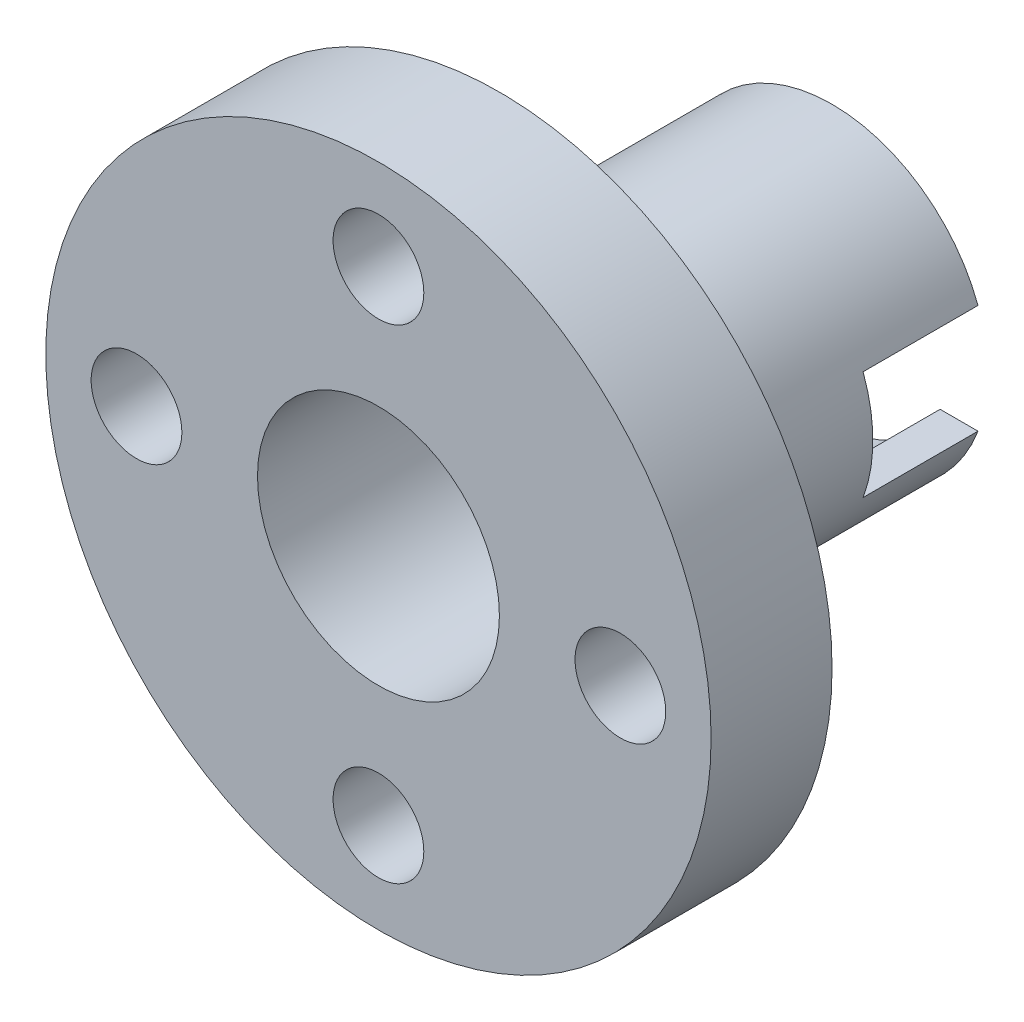
ISO-10303-21;
HEADER;
FILE_DESCRIPTION(('STEP AP214'),'2;1');
FILE_NAME('part.step','',(''),(''),'','','');
FILE_SCHEMA(('AUTOMOTIVE_DESIGN { 1 0 10303 214 1 1 1 1 }'));
ENDSEC;
DATA;
#1=APPLICATION_CONTEXT('core data for automotive mechanical design processes');
#2=APPLICATION_PROTOCOL_DEFINITION('international standard','automotive_design',2000,#1);
#3=PRODUCT_CONTEXT('',#1,'mechanical');
#4=PRODUCT('Part','Part','',(#3));
#5=PRODUCT_RELATED_PRODUCT_CATEGORY('part','',(#4));
#6=PRODUCT_DEFINITION_FORMATION('','',#4);
#7=PRODUCT_DEFINITION_CONTEXT('part definition',#1,'design');
#8=PRODUCT_DEFINITION('design','',#6,#7);
#9=PRODUCT_DEFINITION_SHAPE('','',#8);
#10=(LENGTH_UNIT() NAMED_UNIT(*) SI_UNIT(.MILLI.,.METRE.));
#11=(NAMED_UNIT(*) PLANE_ANGLE_UNIT() SI_UNIT($,.RADIAN.));
#12=(NAMED_UNIT(*) SI_UNIT($,.STERADIAN.) SOLID_ANGLE_UNIT());
#13=UNCERTAINTY_MEASURE_WITH_UNIT(LENGTH_MEASURE(1.E-05),#10,'distance_accuracy_value','');
#14=(GEOMETRIC_REPRESENTATION_CONTEXT(3) GLOBAL_UNCERTAINTY_ASSIGNED_CONTEXT((#13)) GLOBAL_UNIT_ASSIGNED_CONTEXT((#10,
#11,#12)) REPRESENTATION_CONTEXT('',''));
#15=CARTESIAN_POINT('',(0.,0.,0.));
#16=DIRECTION('',(0.,0.,1.));
#17=DIRECTION('',(1.,0.,0.));
#18=AXIS2_PLACEMENT_3D('',#15,#16,#17);
#19=CARTESIAN_POINT('',(0.,0.,-11.));
#20=DIRECTION('',(0.,0.,-1.));
#21=DIRECTION('',(-1.,0.,0.));
#22=AXIS2_PLACEMENT_3D('',#19,#20,#21);
#23=PLANE('',#22);
#24=DIRECTION('',(-1.,0.,0.));
#25=VECTOR('',#24,1.);
#26=CARTESIAN_POINT('',(11.0000000000001,1.79999999999991,-11.));
#27=LINE('',#26,#25);
#28=CARTESIAN_POINT('',(-3.57211421989834,1.80000000000003,-11.));
#29=VERTEX_POINT('',#28);
#30=CARTESIAN_POINT('',(-4.82519429660608,1.80000000000004,-11.));
#31=VERTEX_POINT('',#30);
#32=EDGE_CURVE('E231',#29,#31,#27,.T.);
#33=ORIENTED_EDGE('',*,*,#32,.T.);
#34=CARTESIAN_POINT('',(0.,0.,-11.));
#35=DIRECTION('',(0.,0.,-1.));
#36=DIRECTION('',(-1.,0.,0.));
#37=AXIS2_PLACEMENT_3D('',#34,#35,#36);
#38=CIRCLE('',#37,5.15);
#39=CARTESIAN_POINT('',(4.82519429660611,1.79999999999996,-11.));
#40=VERTEX_POINT('',#39);
#41=EDGE_CURVE('E153',#31,#40,#38,.T.);
#42=ORIENTED_EDGE('',*,*,#41,.T.);
#43=CARTESIAN_POINT('',(3.57211421989837,1.79999999999997,-11.));
#44=VERTEX_POINT('',#43);
#45=EDGE_CURVE('E138',#40,#44,#27,.T.);
#46=ORIENTED_EDGE('',*,*,#45,.T.);
#47=CARTESIAN_POINT('',(0.,0.,-11.));
#48=DIRECTION('',(0.,0.,-1.));
#49=DIRECTION('',(-1.,0.,0.));
#50=AXIS2_PLACEMENT_3D('',#47,#48,#49);
#51=CIRCLE('',#50,4.);
#52=EDGE_CURVE('E201',#29,#44,#51,.T.);
#53=ORIENTED_EDGE('',*,*,#52,.F.);
#54=EDGE_LOOP('',(#33,#42,#46,#53));
#55=FACE_BOUND('',#54,.T.);
#56=ADVANCED_FACE('F39',(#55),#23,.T.);
#57=CARTESIAN_POINT('',(0.,0.,4.));
#58=DIRECTION('',(0.,0.,1.));
#59=DIRECTION('',(1.,0.,0.));
#60=AXIS2_PLACEMENT_3D('',#57,#58,#59);
#61=PLANE('',#60);
#62=CARTESIAN_POINT('',(0.,0.,4.));
#63=DIRECTION('',(0.,0.,-1.));
#64=DIRECTION('',(-1.,0.,0.));
#65=AXIS2_PLACEMENT_3D('',#62,#63,#64);
#66=CIRCLE('',#65,4.);
#67=CARTESIAN_POINT('',(-4.,0.,4.));
#68=VERTEX_POINT('',#67);
#69=EDGE_CURVE('E148',#68,#68,#66,.T.);
#70=ORIENTED_EDGE('',*,*,#69,.T.);
#71=EDGE_LOOP('',(#70));
#72=FACE_BOUND('',#71,.T.);
#73=CARTESIAN_POINT('',(8.,0.,4.));
#74=DIRECTION('',(0.,0.,1.));
#75=DIRECTION('',(1.,0.,0.));
#76=AXIS2_PLACEMENT_3D('',#73,#74,#75);
#77=CIRCLE('',#76,1.5);
#78=CARTESIAN_POINT('',(9.5,0.,4.));
#79=VERTEX_POINT('',#78);
#80=EDGE_CURVE('E171',#79,#79,#77,.T.);
#81=ORIENTED_EDGE('',*,*,#80,.F.);
#82=EDGE_LOOP('',(#81));
#83=FACE_BOUND('',#82,.T.);
#84=CARTESIAN_POINT('',(-8.,0.,4.));
#85=DIRECTION('',(0.,0.,1.));
#86=DIRECTION('',(1.,0.,0.));
#87=AXIS2_PLACEMENT_3D('',#84,#85,#86);
#88=CIRCLE('',#87,1.5);
#89=CARTESIAN_POINT('',(-6.5,0.,4.));
#90=VERTEX_POINT('',#89);
#91=EDGE_CURVE('E187',#90,#90,#88,.T.);
#92=ORIENTED_EDGE('',*,*,#91,.F.);
#93=EDGE_LOOP('',(#92));
#94=FACE_BOUND('',#93,.T.);
#95=CARTESIAN_POINT('',(0.,0.,4.));
#96=DIRECTION('',(0.,0.,1.));
#97=DIRECTION('',(1.,0.,0.));
#98=AXIS2_PLACEMENT_3D('',#95,#96,#97);
#99=CIRCLE('',#98,11.);
#100=CARTESIAN_POINT('',(11.,0.,4.));
#101=VERTEX_POINT('',#100);
#102=EDGE_CURVE('E162',#101,#101,#99,.T.);
#103=ORIENTED_EDGE('',*,*,#102,.T.);
#104=EDGE_LOOP('',(#103));
#105=FACE_BOUND('',#104,.T.);
#106=CARTESIAN_POINT('',(0.,8.,4.));
#107=DIRECTION('',(0.,0.,1.));
#108=DIRECTION('',(1.,0.,0.));
#109=AXIS2_PLACEMENT_3D('',#106,#107,#108);
#110=CIRCLE('',#109,1.5);
#111=CARTESIAN_POINT('',(1.50000000000003,8.,4.));
#112=VERTEX_POINT('',#111);
#113=EDGE_CURVE('E179',#112,#112,#110,.T.);
#114=ORIENTED_EDGE('',*,*,#113,.F.);
#115=EDGE_LOOP('',(#114));
#116=FACE_BOUND('',#115,.T.);
#117=CARTESIAN_POINT('',(0.,-8.,4.));
#118=DIRECTION('',(0.,0.,1.));
#119=DIRECTION('',(1.,0.,0.));
#120=AXIS2_PLACEMENT_3D('',#117,#118,#119);
#121=CIRCLE('',#120,1.5);
#122=CARTESIAN_POINT('',(1.49999999999992,-8.,4.));
#123=VERTEX_POINT('',#122);
#124=EDGE_CURVE('E163',#123,#123,#121,.T.);
#125=ORIENTED_EDGE('',*,*,#124,.F.);
#126=EDGE_LOOP('',(#125));
#127=FACE_BOUND('',#126,.T.);
#128=ADVANCED_FACE('F261',(#72,#83,#94,#105,#116,#127),#61,.T.);
#129=CARTESIAN_POINT('',(0.,0.,0.));
#130=DIRECTION('',(0.,0.,1.));
#131=DIRECTION('',(1.,0.,0.));
#132=AXIS2_PLACEMENT_3D('',#129,#130,#131);
#133=PLANE('',#132);
#134=CARTESIAN_POINT('',(0.,0.,0.));
#135=DIRECTION('',(0.,0.,-1.));
#136=DIRECTION('',(-1.,0.,0.));
#137=AXIS2_PLACEMENT_3D('',#134,#135,#136);
#138=CIRCLE('',#137,5.15);
#139=CARTESIAN_POINT('',(-5.15,0.,0.));
#140=VERTEX_POINT('',#139);
#141=EDGE_CURVE('E158',#140,#140,#138,.T.);
#142=ORIENTED_EDGE('',*,*,#141,.F.);
#143=EDGE_LOOP('',(#142));
#144=FACE_BOUND('',#143,.T.);
#145=CARTESIAN_POINT('',(0.,0.,0.));
#146=DIRECTION('',(0.,0.,1.));
#147=DIRECTION('',(1.,0.,0.));
#148=AXIS2_PLACEMENT_3D('',#145,#146,#147);
#149=CIRCLE('',#148,11.);
#150=CARTESIAN_POINT('',(11.,0.,0.));
#151=VERTEX_POINT('',#150);
#152=EDGE_CURVE('E191',#151,#151,#149,.T.);
#153=ORIENTED_EDGE('',*,*,#152,.F.);
#154=EDGE_LOOP('',(#153));
#155=FACE_BOUND('',#154,.T.);
#156=CARTESIAN_POINT('',(-8.,0.,0.));
#157=DIRECTION('',(0.,0.,1.));
#158=DIRECTION('',(1.,0.,0.));
#159=AXIS2_PLACEMENT_3D('',#156,#157,#158);
#160=CIRCLE('',#159,1.5);
#161=CARTESIAN_POINT('',(-6.5,0.,0.));
#162=VERTEX_POINT('',#161);
#163=EDGE_CURVE('E183',#162,#162,#160,.T.);
#164=ORIENTED_EDGE('',*,*,#163,.T.);
#165=EDGE_LOOP('',(#164));
#166=FACE_BOUND('',#165,.T.);
#167=CARTESIAN_POINT('',(0.,8.,0.));
#168=DIRECTION('',(0.,0.,1.));
#169=DIRECTION('',(1.,0.,0.));
#170=AXIS2_PLACEMENT_3D('',#167,#168,#169);
#171=CIRCLE('',#170,1.5);
#172=CARTESIAN_POINT('',(1.50000000000003,8.,0.));
#173=VERTEX_POINT('',#172);
#174=EDGE_CURVE('E175',#173,#173,#171,.T.);
#175=ORIENTED_EDGE('',*,*,#174,.T.);
#176=EDGE_LOOP('',(#175));
#177=FACE_BOUND('',#176,.T.);
#178=CARTESIAN_POINT('',(8.,0.,0.));
#179=DIRECTION('',(0.,0.,1.));
#180=DIRECTION('',(1.,0.,0.));
#181=AXIS2_PLACEMENT_3D('',#178,#179,#180);
#182=CIRCLE('',#181,1.5);
#183=CARTESIAN_POINT('',(9.5,0.,0.));
#184=VERTEX_POINT('',#183);
#185=EDGE_CURVE('E167',#184,#184,#182,.T.);
#186=ORIENTED_EDGE('',*,*,#185,.T.);
#187=EDGE_LOOP('',(#186));
#188=FACE_BOUND('',#187,.T.);
#189=CARTESIAN_POINT('',(0.,-8.,0.));
#190=DIRECTION('',(0.,0.,1.));
#191=DIRECTION('',(1.,0.,0.));
#192=AXIS2_PLACEMENT_3D('',#189,#190,#191);
#193=CIRCLE('',#192,1.5);
#194=CARTESIAN_POINT('',(1.49999999999992,-8.,0.));
#195=VERTEX_POINT('',#194);
#196=EDGE_CURVE('E157',#195,#195,#193,.T.);
#197=ORIENTED_EDGE('',*,*,#196,.T.);
#198=EDGE_LOOP('',(#197));
#199=FACE_BOUND('',#198,.T.);
#200=ADVANCED_FACE('F266',(#144,#155,#166,#177,#188,#199),#133,.F.);
#201=CARTESIAN_POINT('',(0.,0.,4.));
#202=DIRECTION('',(0.,0.,-1.));
#203=DIRECTION('',(-1.,0.,0.));
#204=AXIS2_PLACEMENT_3D('',#201,#202,#203);
#205=CYLINDRICAL_SURFACE('',#204,11.);
#206=ORIENTED_EDGE('',*,*,#102,.F.);
#207=EDGE_LOOP('',(#206));
#208=FACE_BOUND('',#207,.T.);
#209=ORIENTED_EDGE('',*,*,#152,.T.);
#210=EDGE_LOOP('',(#209));
#211=FACE_BOUND('',#210,.T.);
#212=ADVANCED_FACE('F41',(#208,#211),#205,.T.);
#213=CARTESIAN_POINT('',(-8.,0.,4.));
#214=DIRECTION('',(0.,0.,-1.));
#215=DIRECTION('',(-1.,0.,0.));
#216=AXIS2_PLACEMENT_3D('',#213,#214,#215);
#217=CYLINDRICAL_SURFACE('',#216,1.5);
#218=ORIENTED_EDGE('',*,*,#91,.T.);
#219=EDGE_LOOP('',(#218));
#220=FACE_BOUND('',#219,.T.);
#221=ORIENTED_EDGE('',*,*,#163,.F.);
#222=EDGE_LOOP('',(#221));
#223=FACE_BOUND('',#222,.T.);
#224=ADVANCED_FACE('F290',(#220,#223),#217,.F.);
#225=CARTESIAN_POINT('',(0.,8.,4.));
#226=DIRECTION('',(0.,0.,-1.));
#227=DIRECTION('',(-1.,0.,0.));
#228=AXIS2_PLACEMENT_3D('',#225,#226,#227);
#229=CYLINDRICAL_SURFACE('',#228,1.5);
#230=ORIENTED_EDGE('',*,*,#113,.T.);
#231=EDGE_LOOP('',(#230));
#232=FACE_BOUND('',#231,.T.);
#233=ORIENTED_EDGE('',*,*,#174,.F.);
#234=EDGE_LOOP('',(#233));
#235=FACE_BOUND('',#234,.T.);
#236=ADVANCED_FACE('F286',(#232,#235),#229,.F.);
#237=CARTESIAN_POINT('',(8.,0.,4.));
#238=DIRECTION('',(0.,0.,-1.));
#239=DIRECTION('',(-1.,0.,0.));
#240=AXIS2_PLACEMENT_3D('',#237,#238,#239);
#241=CYLINDRICAL_SURFACE('',#240,1.5);
#242=ORIENTED_EDGE('',*,*,#80,.T.);
#243=EDGE_LOOP('',(#242));
#244=FACE_BOUND('',#243,.T.);
#245=ORIENTED_EDGE('',*,*,#185,.F.);
#246=EDGE_LOOP('',(#245));
#247=FACE_BOUND('',#246,.T.);
#248=ADVANCED_FACE('F280',(#244,#247),#241,.F.);
#249=CARTESIAN_POINT('',(0.,-8.,4.));
#250=DIRECTION('',(0.,0.,-1.));
#251=DIRECTION('',(-1.,0.,0.));
#252=AXIS2_PLACEMENT_3D('',#249,#250,#251);
#253=CYLINDRICAL_SURFACE('',#252,1.5);
#254=ORIENTED_EDGE('',*,*,#124,.T.);
#255=EDGE_LOOP('',(#254));
#256=FACE_BOUND('',#255,.T.);
#257=ORIENTED_EDGE('',*,*,#196,.F.);
#258=EDGE_LOOP('',(#257));
#259=FACE_BOUND('',#258,.T.);
#260=ADVANCED_FACE('F276',(#256,#259),#253,.F.);
#261=CARTESIAN_POINT('',(0.,0.,-11.));
#262=DIRECTION('',(0.,0.,1.));
#263=DIRECTION('',(1.,0.,0.));
#264=AXIS2_PLACEMENT_3D('',#261,#262,#263);
#265=CYLINDRICAL_SURFACE('',#264,5.15);
#266=CARTESIAN_POINT('',(0.,0.,-7.2));
#267=DIRECTION('',(0.,0.,1.));
#268=DIRECTION('',(0.,-1.,0.));
#269=AXIS2_PLACEMENT_3D('',#266,#267,#268);
#270=CIRCLE('',#269,5.15);
#271=CARTESIAN_POINT('',(4.82519429660608,-1.80000000000004,-7.2));
#272=VERTEX_POINT('',#271);
#273=CARTESIAN_POINT('',(4.82519429660611,1.79999999999996,-7.2));
#274=VERTEX_POINT('',#273);
#275=EDGE_CURVE('E106',#272,#274,#270,.T.);
#276=ORIENTED_EDGE('',*,*,#275,.T.);
#277=DIRECTION('',(0.,0.,1.));
#278=VECTOR('',#277,1.);
#279=CARTESIAN_POINT('',(4.82519429660611,1.79999999999996,-11.));
#280=LINE('',#279,#278);
#281=EDGE_CURVE('E117',#274,#40,#280,.F.);
#282=ORIENTED_EDGE('',*,*,#281,.T.);
#283=ORIENTED_EDGE('',*,*,#41,.F.);
#284=DIRECTION('',(0.,0.,1.));
#285=VECTOR('',#284,1.);
#286=CARTESIAN_POINT('',(-4.82519429660608,1.80000000000004,-11.));
#287=LINE('',#286,#285);
#288=CARTESIAN_POINT('',(-4.82519429660608,1.80000000000004,-7.2));
#289=VERTEX_POINT('',#288);
#290=EDGE_CURVE('E144',#31,#289,#287,.T.);
#291=ORIENTED_EDGE('',*,*,#290,.T.);
#292=CARTESIAN_POINT('',(-4.82519429660611,-1.79999999999996,-7.2));
#293=VERTEX_POINT('',#292);
#294=EDGE_CURVE('E118',#289,#293,#270,.T.);
#295=ORIENTED_EDGE('',*,*,#294,.T.);
#296=DIRECTION('',(0.,0.,1.));
#297=VECTOR('',#296,1.);
#298=CARTESIAN_POINT('',(-4.82519429660611,-1.79999999999996,-11.));
#299=LINE('',#298,#297);
#300=CARTESIAN_POINT('',(-4.82519429660611,-1.79999999999996,-11.));
#301=VERTEX_POINT('',#300);
#302=EDGE_CURVE('E133',#293,#301,#299,.F.);
#303=ORIENTED_EDGE('',*,*,#302,.T.);
#304=CARTESIAN_POINT('',(4.82519429660608,-1.80000000000004,-11.));
#305=VERTEX_POINT('',#304);
#306=EDGE_CURVE('E131',#305,#301,#38,.T.);
#307=ORIENTED_EDGE('',*,*,#306,.F.);
#308=DIRECTION('',(0.,0.,1.));
#309=VECTOR('',#308,1.);
#310=CARTESIAN_POINT('',(4.82519429660608,-1.80000000000004,-11.));
#311=LINE('',#310,#309);
#312=EDGE_CURVE('E121',#305,#272,#311,.T.);
#313=ORIENTED_EDGE('',*,*,#312,.T.);
#314=EDGE_LOOP('',(#276,#282,#283,#291,#295,#303,#307,#313));
#315=FACE_BOUND('',#314,.T.);
#316=ORIENTED_EDGE('',*,*,#141,.T.);
#317=EDGE_LOOP('',(#316));
#318=FACE_BOUND('',#317,.T.);
#319=ADVANCED_FACE('F127',(#315,#318),#265,.T.);
#320=DIRECTION('',(-1.,0.,0.));
#321=VECTOR('',#320,1.);
#322=CARTESIAN_POINT('',(11.0000000000001,-1.80000000000009,-11.));
#323=LINE('',#322,#321);
#324=CARTESIAN_POINT('',(3.57211421989833,-1.80000000000003,-11.));
#325=VERTEX_POINT('',#324);
#326=EDGE_CURVE('E63',#305,#325,#323,.T.);
#327=ORIENTED_EDGE('',*,*,#326,.F.);
#328=ORIENTED_EDGE('',*,*,#306,.T.);
#329=CARTESIAN_POINT('',(-3.57211421989837,-1.79999999999997,-11.));
#330=VERTEX_POINT('',#329);
#331=EDGE_CURVE('E234',#330,#301,#323,.T.);
#332=ORIENTED_EDGE('',*,*,#331,.F.);
#333=EDGE_CURVE('E152',#325,#330,#51,.T.);
#334=ORIENTED_EDGE('',*,*,#333,.F.);
#335=EDGE_LOOP('',(#327,#328,#332,#334));
#336=FACE_BOUND('',#335,.T.);
#337=ADVANCED_FACE('F241',(#336),#23,.T.);
#338=CARTESIAN_POINT('',(0.,0.,4.));
#339=DIRECTION('',(0.,0.,-1.));
#340=DIRECTION('',(-1.,0.,0.));
#341=AXIS2_PLACEMENT_3D('',#338,#339,#340);
#342=CYLINDRICAL_SURFACE('',#341,4.);
#343=CARTESIAN_POINT('',(0.,0.,-7.2));
#344=DIRECTION('',(0.,0.,1.));
#345=DIRECTION('',(0.,-1.,0.));
#346=AXIS2_PLACEMENT_3D('',#343,#344,#345);
#347=CIRCLE('',#346,4.);
#348=CARTESIAN_POINT('',(-3.57211421989837,-1.79999999999997,-7.2));
#349=VERTEX_POINT('',#348);
#350=CARTESIAN_POINT('',(-3.57211421989833,1.80000000000003,-7.2));
#351=VERTEX_POINT('',#350);
#352=EDGE_CURVE('E48',#349,#351,#347,.F.);
#353=ORIENTED_EDGE('',*,*,#352,.T.);
#354=DIRECTION('',(0.,0.,-1.));
#355=VECTOR('',#354,1.);
#356=CARTESIAN_POINT('',(-3.57211421989833,1.80000000000003,4.));
#357=LINE('',#356,#355);
#358=EDGE_CURVE('E11',#351,#29,#357,.T.);
#359=ORIENTED_EDGE('',*,*,#358,.T.);
#360=ORIENTED_EDGE('',*,*,#52,.T.);
#361=DIRECTION('',(0.,0.,-1.));
#362=VECTOR('',#361,1.);
#363=CARTESIAN_POINT('',(3.57211421989837,1.79999999999997,4.));
#364=LINE('',#363,#362);
#365=CARTESIAN_POINT('',(3.57211421989837,1.79999999999997,-7.2));
#366=VERTEX_POINT('',#365);
#367=EDGE_CURVE('E210',#44,#366,#364,.F.);
#368=ORIENTED_EDGE('',*,*,#367,.T.);
#369=CARTESIAN_POINT('',(3.57211421989834,-1.80000000000003,-7.2));
#370=VERTEX_POINT('',#369);
#371=EDGE_CURVE('E207',#366,#370,#347,.F.);
#372=ORIENTED_EDGE('',*,*,#371,.T.);
#373=DIRECTION('',(0.,0.,-1.));
#374=VECTOR('',#373,1.);
#375=CARTESIAN_POINT('',(3.57211421989833,-1.80000000000003,4.));
#376=LINE('',#375,#374);
#377=EDGE_CURVE('E122',#370,#325,#376,.T.);
#378=ORIENTED_EDGE('',*,*,#377,.T.);
#379=ORIENTED_EDGE('',*,*,#333,.T.);
#380=DIRECTION('',(0.,0.,-1.));
#381=VECTOR('',#380,1.);
#382=CARTESIAN_POINT('',(-3.57211421989837,-1.79999999999997,4.));
#383=LINE('',#382,#381);
#384=EDGE_CURVE('E213',#330,#349,#383,.F.);
#385=ORIENTED_EDGE('',*,*,#384,.T.);
#386=EDGE_LOOP('',(#353,#359,#360,#368,#372,#378,#379,#385));
#387=FACE_BOUND('',#386,.T.);
#388=ORIENTED_EDGE('',*,*,#69,.F.);
#389=EDGE_LOOP('',(#388));
#390=FACE_BOUND('',#389,.T.);
#391=ADVANCED_FACE('F220',(#387,#390),#342,.F.);
#392=CARTESIAN_POINT('',(11.0000000000001,-1.80000000000009,-11.));
#393=DIRECTION('',(0.,-1.,0.));
#394=DIRECTION('',(1.,0.,0.));
#395=AXIS2_PLACEMENT_3D('',#392,#393,#394);
#396=PLANE('',#395);
#397=ORIENTED_EDGE('',*,*,#326,.T.);
#398=ORIENTED_EDGE('',*,*,#377,.F.);
#399=DIRECTION('',(-1.,0.,0.));
#400=VECTOR('',#399,1.);
#401=CARTESIAN_POINT('',(11.0000000000001,-1.80000000000009,-7.2));
#402=LINE('',#401,#400);
#403=EDGE_CURVE('E109',#272,#370,#402,.T.);
#404=ORIENTED_EDGE('',*,*,#403,.F.);
#405=ORIENTED_EDGE('',*,*,#312,.F.);
#406=EDGE_LOOP('',(#397,#398,#404,#405));
#407=FACE_BOUND('',#406,.T.);
#408=ADVANCED_FACE('F120',(#407),#396,.F.);
#409=CARTESIAN_POINT('',(11.0000000000001,1.79999999999991,-7.2));
#410=DIRECTION('',(0.,0.,1.));
#411=DIRECTION('',(0.,-1.,0.));
#412=AXIS2_PLACEMENT_3D('',#409,#410,#411);
#413=PLANE('',#412);
#414=ORIENTED_EDGE('',*,*,#403,.T.);
#415=ORIENTED_EDGE('',*,*,#371,.F.);
#416=DIRECTION('',(-1.,0.,0.));
#417=VECTOR('',#416,1.);
#418=CARTESIAN_POINT('',(11.0000000000001,1.79999999999991,-7.2));
#419=LINE('',#418,#417);
#420=EDGE_CURVE('E112',#274,#366,#419,.T.);
#421=ORIENTED_EDGE('',*,*,#420,.F.);
#422=ORIENTED_EDGE('',*,*,#275,.F.);
#423=EDGE_LOOP('',(#414,#415,#421,#422));
#424=FACE_BOUND('',#423,.T.);
#425=ADVANCED_FACE('F108',(#424),#413,.F.);
#426=CARTESIAN_POINT('',(11.0000000000001,1.79999999999991,-11.));
#427=DIRECTION('',(0.,1.,0.));
#428=DIRECTION('',(-1.,0.,0.));
#429=AXIS2_PLACEMENT_3D('',#426,#427,#428);
#430=PLANE('',#429);
#431=ORIENTED_EDGE('',*,*,#420,.T.);
#432=ORIENTED_EDGE('',*,*,#367,.F.);
#433=ORIENTED_EDGE('',*,*,#45,.F.);
#434=ORIENTED_EDGE('',*,*,#281,.F.);
#435=EDGE_LOOP('',(#431,#432,#433,#434));
#436=FACE_BOUND('',#435,.T.);
#437=ADVANCED_FACE('F245',(#436),#430,.F.);
#438=ORIENTED_EDGE('',*,*,#32,.F.);
#439=ORIENTED_EDGE('',*,*,#358,.F.);
#440=EDGE_CURVE('E124',#351,#289,#419,.T.);
#441=ORIENTED_EDGE('',*,*,#440,.T.);
#442=ORIENTED_EDGE('',*,*,#290,.F.);
#443=EDGE_LOOP('',(#438,#439,#441,#442));
#444=FACE_BOUND('',#443,.T.);
#445=ADVANCED_FACE('F252',(#444),#430,.F.);
#446=ORIENTED_EDGE('',*,*,#440,.F.);
#447=ORIENTED_EDGE('',*,*,#352,.F.);
#448=EDGE_CURVE('E55',#349,#293,#402,.T.);
#449=ORIENTED_EDGE('',*,*,#448,.T.);
#450=ORIENTED_EDGE('',*,*,#294,.F.);
#451=EDGE_LOOP('',(#446,#447,#449,#450));
#452=FACE_BOUND('',#451,.T.);
#453=ADVANCED_FACE('F225',(#452),#413,.F.);
#454=ORIENTED_EDGE('',*,*,#448,.F.);
#455=ORIENTED_EDGE('',*,*,#384,.F.);
#456=ORIENTED_EDGE('',*,*,#331,.T.);
#457=ORIENTED_EDGE('',*,*,#302,.F.);
#458=EDGE_LOOP('',(#454,#455,#456,#457));
#459=FACE_BOUND('',#458,.T.);
#460=ADVANCED_FACE('F238',(#459),#396,.F.);
#461=CLOSED_SHELL('',(#56,#128,#200,#212,#224,#236,#248,#260,#319,#337,#391,#408,#425,#437,#445,
#453,#460));
#462=MANIFOLD_SOLID_BREP('B2',#461);
#463=ADVANCED_BREP_SHAPE_REPRESENTATION('',(#18,#462),#14);
#464=SHAPE_DEFINITION_REPRESENTATION(#9,#463);
ENDSEC;
END-ISO-10303-21;
